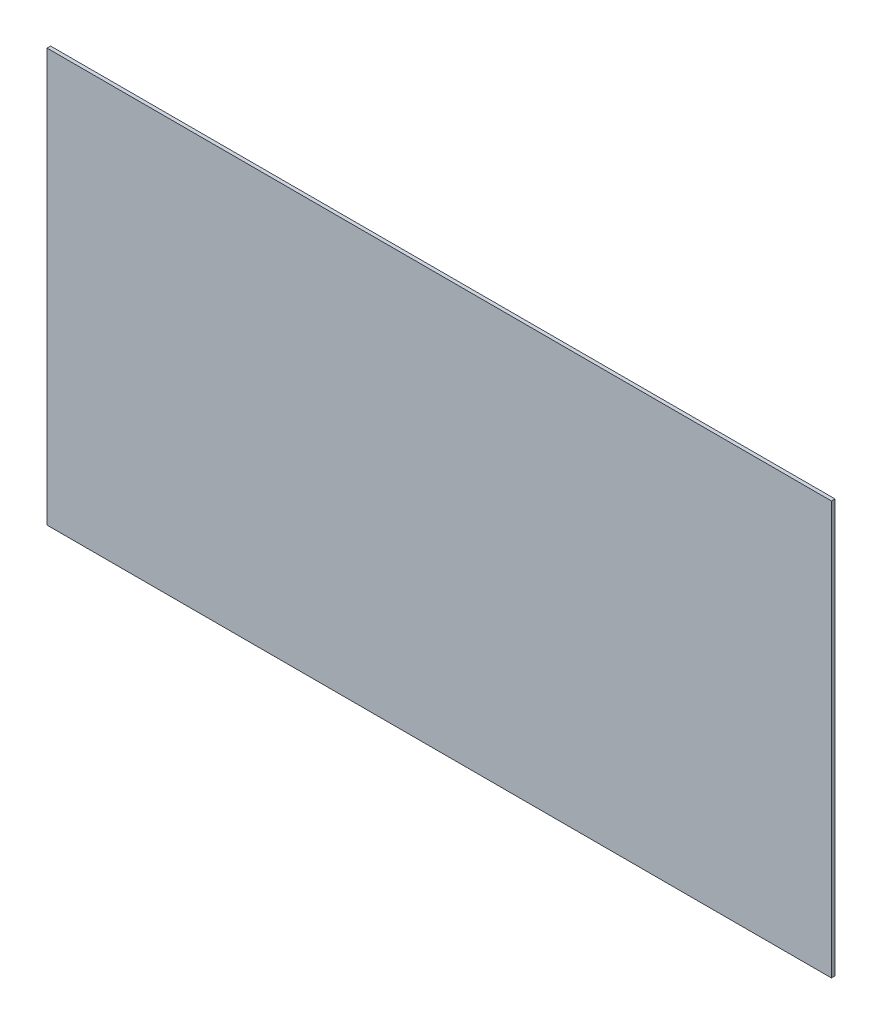
ISO-10303-21;
HEADER;
FILE_DESCRIPTION(('STEP AP214'),'2;1');
FILE_NAME('part.step','',(''),(''),'','','');
FILE_SCHEMA(('AUTOMOTIVE_DESIGN { 1 0 10303 214 1 1 1 1 }'));
ENDSEC;
DATA;
#1=APPLICATION_CONTEXT('core data for automotive mechanical design processes');
#2=APPLICATION_PROTOCOL_DEFINITION('international standard','automotive_design',2000,#1);
#3=PRODUCT_CONTEXT('',#1,'mechanical');
#4=PRODUCT('Part','Part','',(#3));
#5=PRODUCT_RELATED_PRODUCT_CATEGORY('part','',(#4));
#6=PRODUCT_DEFINITION_FORMATION('','',#4);
#7=PRODUCT_DEFINITION_CONTEXT('part definition',#1,'design');
#8=PRODUCT_DEFINITION('design','',#6,#7);
#9=PRODUCT_DEFINITION_SHAPE('','',#8);
#10=(LENGTH_UNIT() NAMED_UNIT(*) SI_UNIT(.MILLI.,.METRE.));
#11=(NAMED_UNIT(*) PLANE_ANGLE_UNIT() SI_UNIT($,.RADIAN.));
#12=(NAMED_UNIT(*) SI_UNIT($,.STERADIAN.) SOLID_ANGLE_UNIT());
#13=UNCERTAINTY_MEASURE_WITH_UNIT(LENGTH_MEASURE(1.E-05),#10,'distance_accuracy_value','');
#14=(GEOMETRIC_REPRESENTATION_CONTEXT(3) GLOBAL_UNCERTAINTY_ASSIGNED_CONTEXT((#13)) GLOBAL_UNIT_ASSIGNED_CONTEXT((#10,
#11,#12)) REPRESENTATION_CONTEXT('',''));
#15=CARTESIAN_POINT('',(0.,0.,0.));
#16=DIRECTION('',(0.,0.,1.));
#17=DIRECTION('',(1.,0.,0.));
#18=AXIS2_PLACEMENT_3D('',#15,#16,#17);
#19=CARTESIAN_POINT('',(-165.1,788.53,0.75));
#20=DIRECTION('',(1.,0.,0.));
#21=DIRECTION('',(0.,0.,-1.));
#22=AXIS2_PLACEMENT_3D('',#19,#20,#21);
#23=PLANE('',#22);
#24=DIRECTION('',(0.,-1.,0.));
#25=VECTOR('',#24,1.);
#26=CARTESIAN_POINT('',(-165.1,788.53,-0.75));
#27=LINE('',#26,#25);
#28=CARTESIAN_POINT('',(-165.1,962.43,-0.75));
#29=VERTEX_POINT('',#28);
#30=CARTESIAN_POINT('',(-165.1,788.53,-0.75));
#31=VERTEX_POINT('',#30);
#32=EDGE_CURVE('E96',#29,#31,#27,.T.);
#33=ORIENTED_EDGE('',*,*,#32,.T.);
#34=DIRECTION('',(0.,0.,-1.));
#35=VECTOR('',#34,1.);
#36=CARTESIAN_POINT('',(-165.1,788.53,0.75));
#37=LINE('',#36,#35);
#38=CARTESIAN_POINT('',(-165.1,788.53,0.75));
#39=VERTEX_POINT('',#38);
#40=EDGE_CURVE('E11',#39,#31,#37,.T.);
#41=ORIENTED_EDGE('',*,*,#40,.F.);
#42=DIRECTION('',(0.,-1.,0.));
#43=VECTOR('',#42,1.);
#44=CARTESIAN_POINT('',(-165.1,788.53,0.75));
#45=LINE('',#44,#43);
#46=CARTESIAN_POINT('',(-165.1,962.43,0.75));
#47=VERTEX_POINT('',#46);
#48=EDGE_CURVE('E84',#47,#39,#45,.T.);
#49=ORIENTED_EDGE('',*,*,#48,.F.);
#50=DIRECTION('',(0.,0.,-1.));
#51=VECTOR('',#50,1.);
#52=CARTESIAN_POINT('',(-165.1,962.43,0.75));
#53=LINE('',#52,#51);
#54=EDGE_CURVE('E92',#47,#29,#53,.T.);
#55=ORIENTED_EDGE('',*,*,#54,.T.);
#56=EDGE_LOOP('',(#33,#41,#49,#55));
#57=FACE_BOUND('',#56,.T.);
#58=ADVANCED_FACE('F33',(#57),#23,.F.);
#59=CARTESIAN_POINT('',(-165.1,788.53,0.75));
#60=DIRECTION('',(0.,1.,0.));
#61=DIRECTION('',(0.,0.,1.));
#62=AXIS2_PLACEMENT_3D('',#59,#60,#61);
#63=PLANE('',#62);
#64=DIRECTION('',(1.,0.,0.));
#65=VECTOR('',#64,1.);
#66=CARTESIAN_POINT('',(-165.1,788.53,-0.75));
#67=LINE('',#66,#65);
#68=CARTESIAN_POINT('',(165.1,788.53,-0.75));
#69=VERTEX_POINT('',#68);
#70=EDGE_CURVE('E88',#31,#69,#67,.T.);
#71=ORIENTED_EDGE('',*,*,#70,.T.);
#72=DIRECTION('',(0.,0.,-1.));
#73=VECTOR('',#72,1.);
#74=CARTESIAN_POINT('',(165.1,788.53,0.75));
#75=LINE('',#74,#73);
#76=CARTESIAN_POINT('',(165.1,788.53,0.75));
#77=VERTEX_POINT('',#76);
#78=EDGE_CURVE('E41',#77,#69,#75,.T.);
#79=ORIENTED_EDGE('',*,*,#78,.F.);
#80=DIRECTION('',(1.,0.,0.));
#81=VECTOR('',#80,1.);
#82=CARTESIAN_POINT('',(-165.1,788.53,0.75));
#83=LINE('',#82,#81);
#84=EDGE_CURVE('E79',#39,#77,#83,.T.);
#85=ORIENTED_EDGE('',*,*,#84,.F.);
#86=ORIENTED_EDGE('',*,*,#40,.T.);
#87=EDGE_LOOP('',(#71,#79,#85,#86));
#88=FACE_BOUND('',#87,.T.);
#89=ADVANCED_FACE('F87',(#88),#63,.F.);
#90=CARTESIAN_POINT('',(165.1,788.53,0.75));
#91=DIRECTION('',(-1.,0.,0.));
#92=DIRECTION('',(0.,0.,1.));
#93=AXIS2_PLACEMENT_3D('',#90,#91,#92);
#94=PLANE('',#93);
#95=DIRECTION('',(0.,1.,0.));
#96=VECTOR('',#95,1.);
#97=CARTESIAN_POINT('',(165.1,788.53,-0.75));
#98=LINE('',#97,#96);
#99=CARTESIAN_POINT('',(165.1,962.43,-0.75));
#100=VERTEX_POINT('',#99);
#101=EDGE_CURVE('E66',#69,#100,#98,.T.);
#102=ORIENTED_EDGE('',*,*,#101,.T.);
#103=DIRECTION('',(0.,0.,-1.));
#104=VECTOR('',#103,1.);
#105=CARTESIAN_POINT('',(165.1,962.43,0.75));
#106=LINE('',#105,#104);
#107=CARTESIAN_POINT('',(165.1,962.43,0.75));
#108=VERTEX_POINT('',#107);
#109=EDGE_CURVE('E89',#108,#100,#106,.T.);
#110=ORIENTED_EDGE('',*,*,#109,.F.);
#111=DIRECTION('',(0.,1.,0.));
#112=VECTOR('',#111,1.);
#113=CARTESIAN_POINT('',(165.1,788.53,0.75));
#114=LINE('',#113,#112);
#115=EDGE_CURVE('E82',#77,#108,#114,.T.);
#116=ORIENTED_EDGE('',*,*,#115,.F.);
#117=ORIENTED_EDGE('',*,*,#78,.T.);
#118=EDGE_LOOP('',(#102,#110,#116,#117));
#119=FACE_BOUND('',#118,.T.);
#120=ADVANCED_FACE('F90',(#119),#94,.F.);
#121=CARTESIAN_POINT('',(-165.1,962.43,0.75));
#122=DIRECTION('',(0.,-1.,0.));
#123=DIRECTION('',(0.,0.,-1.));
#124=AXIS2_PLACEMENT_3D('',#121,#122,#123);
#125=PLANE('',#124);
#126=DIRECTION('',(-1.,0.,0.));
#127=VECTOR('',#126,1.);
#128=CARTESIAN_POINT('',(-165.1,962.43,-0.75));
#129=LINE('',#128,#127);
#130=EDGE_CURVE('E72',#100,#29,#129,.T.);
#131=ORIENTED_EDGE('',*,*,#130,.T.);
#132=ORIENTED_EDGE('',*,*,#54,.F.);
#133=DIRECTION('',(-1.,0.,0.));
#134=VECTOR('',#133,1.);
#135=CARTESIAN_POINT('',(-165.1,962.43,0.75));
#136=LINE('',#135,#134);
#137=EDGE_CURVE('E49',#108,#47,#136,.T.);
#138=ORIENTED_EDGE('',*,*,#137,.F.);
#139=ORIENTED_EDGE('',*,*,#109,.T.);
#140=EDGE_LOOP('',(#131,#132,#138,#139));
#141=FACE_BOUND('',#140,.T.);
#142=ADVANCED_FACE('F103',(#141),#125,.F.);
#143=CARTESIAN_POINT('',(-165.1,962.43,0.75));
#144=DIRECTION('',(0.,0.,-1.));
#145=DIRECTION('',(-1.,0.,0.));
#146=AXIS2_PLACEMENT_3D('',#143,#144,#145);
#147=PLANE('',#146);
#148=ORIENTED_EDGE('',*,*,#48,.T.);
#149=ORIENTED_EDGE('',*,*,#84,.T.);
#150=ORIENTED_EDGE('',*,*,#115,.T.);
#151=ORIENTED_EDGE('',*,*,#137,.T.);
#152=EDGE_LOOP('',(#148,#149,#150,#151));
#153=FACE_BOUND('',#152,.T.);
#154=ADVANCED_FACE('F80',(#153),#147,.F.);
#155=CARTESIAN_POINT('',(-165.1,962.43,-0.75));
#156=DIRECTION('',(0.,0.,-1.));
#157=DIRECTION('',(-1.,0.,0.));
#158=AXIS2_PLACEMENT_3D('',#155,#156,#157);
#159=PLANE('',#158);
#160=ORIENTED_EDGE('',*,*,#32,.F.);
#161=ORIENTED_EDGE('',*,*,#130,.F.);
#162=ORIENTED_EDGE('',*,*,#101,.F.);
#163=ORIENTED_EDGE('',*,*,#70,.F.);
#164=EDGE_LOOP('',(#160,#161,#162,#163));
#165=FACE_BOUND('',#164,.T.);
#166=ADVANCED_FACE('F106',(#165),#159,.T.);
#167=CLOSED_SHELL('',(#58,#89,#120,#142,#154,#166));
#168=MANIFOLD_SOLID_BREP('B2',#167);
#169=ADVANCED_BREP_SHAPE_REPRESENTATION('',(#18,#168),#14);
#170=SHAPE_DEFINITION_REPRESENTATION(#9,#169);
ENDSEC;
END-ISO-10303-21;
